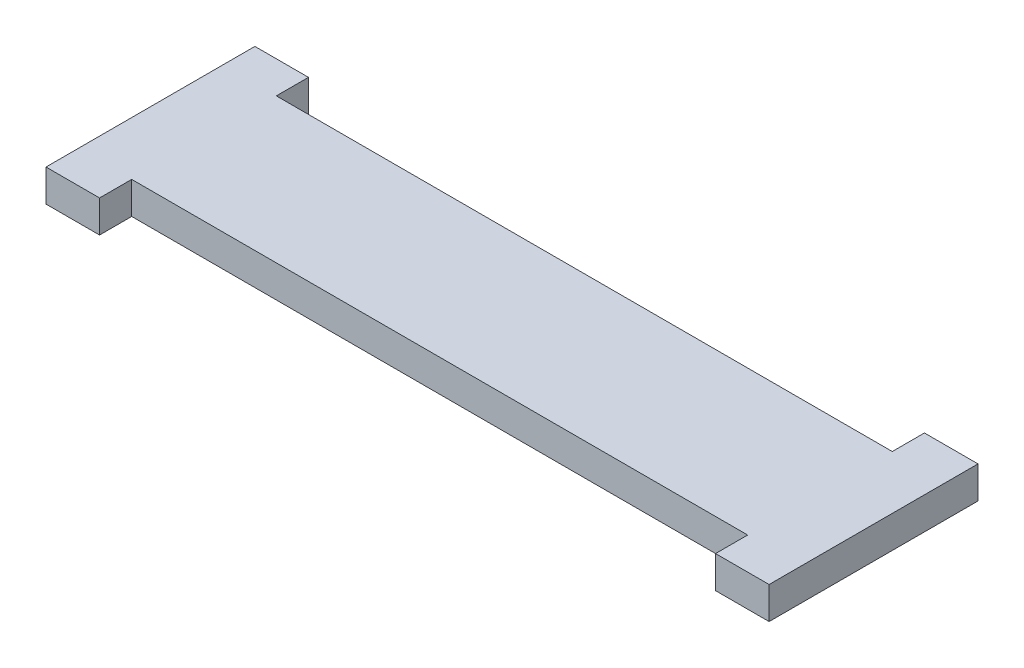
ISO-10303-21;
HEADER;
FILE_DESCRIPTION(('STEP AP214'),'2;1');
FILE_NAME('part.step','',(''),(''),'','','');
FILE_SCHEMA(('AUTOMOTIVE_DESIGN { 1 0 10303 214 1 1 1 1 }'));
ENDSEC;
DATA;
#1=APPLICATION_CONTEXT('core data for automotive mechanical design processes');
#2=APPLICATION_PROTOCOL_DEFINITION('international standard','automotive_design',2000,#1);
#3=PRODUCT_CONTEXT('',#1,'mechanical');
#4=PRODUCT('Part','Part','',(#3));
#5=PRODUCT_RELATED_PRODUCT_CATEGORY('part','',(#4));
#6=PRODUCT_DEFINITION_FORMATION('','',#4);
#7=PRODUCT_DEFINITION_CONTEXT('part definition',#1,'design');
#8=PRODUCT_DEFINITION('design','',#6,#7);
#9=PRODUCT_DEFINITION_SHAPE('','',#8);
#10=(LENGTH_UNIT() NAMED_UNIT(*) SI_UNIT(.MILLI.,.METRE.));
#11=(NAMED_UNIT(*) PLANE_ANGLE_UNIT() SI_UNIT($,.RADIAN.));
#12=(NAMED_UNIT(*) SI_UNIT($,.STERADIAN.) SOLID_ANGLE_UNIT());
#13=UNCERTAINTY_MEASURE_WITH_UNIT(LENGTH_MEASURE(1.E-05),#10,'distance_accuracy_value','');
#14=(GEOMETRIC_REPRESENTATION_CONTEXT(3) GLOBAL_UNCERTAINTY_ASSIGNED_CONTEXT((#13)) GLOBAL_UNIT_ASSIGNED_CONTEXT((#10,
#11,#12)) REPRESENTATION_CONTEXT('',''));
#15=CARTESIAN_POINT('',(0.,0.,0.));
#16=DIRECTION('',(0.,0.,1.));
#17=DIRECTION('',(1.,0.,0.));
#18=AXIS2_PLACEMENT_3D('',#15,#16,#17);
#19=CARTESIAN_POINT('',(-57.5,19.5,-5.));
#20=DIRECTION('',(1.,0.,0.));
#21=DIRECTION('',(0.,0.,-1.));
#22=AXIS2_PLACEMENT_3D('',#19,#20,#21);
#23=PLANE('',#22);
#24=DIRECTION('',(0.,1.,0.));
#25=VECTOR('',#24,1.);
#26=CARTESIAN_POINT('',(-57.5,19.5,0.999999999999994));
#27=LINE('',#26,#25);
#28=CARTESIAN_POINT('',(-57.5,13.5,0.999999999999994));
#29=VERTEX_POINT('',#28);
#30=CARTESIAN_POINT('',(-57.5,19.5,0.999999999999994));
#31=VERTEX_POINT('',#30);
#32=EDGE_CURVE('E11',#29,#31,#27,.T.);
#33=ORIENTED_EDGE('',*,*,#32,.F.);
#34=DIRECTION('',(0.,0.,1.));
#35=VECTOR('',#34,1.);
#36=CARTESIAN_POINT('',(-57.5,13.5,0.));
#37=LINE('',#36,#35);
#38=CARTESIAN_POINT('',(-57.5,13.5,-5.));
#39=VERTEX_POINT('',#38);
#40=EDGE_CURVE('E120',#29,#39,#37,.F.);
#41=ORIENTED_EDGE('',*,*,#40,.T.);
#42=DIRECTION('',(0.,1.,0.));
#43=VECTOR('',#42,1.);
#44=CARTESIAN_POINT('',(-57.5,19.5,-5.));
#45=LINE('',#44,#43);
#46=CARTESIAN_POINT('',(-57.5,19.5,-5.));
#47=VERTEX_POINT('',#46);
#48=EDGE_CURVE('E50',#39,#47,#45,.T.);
#49=ORIENTED_EDGE('',*,*,#48,.T.);
#50=DIRECTION('',(0.,0.,-1.));
#51=VECTOR('',#50,1.);
#52=CARTESIAN_POINT('',(-57.5,19.5,-5.));
#53=LINE('',#52,#51);
#54=EDGE_CURVE('E208',#31,#47,#53,.T.);
#55=ORIENTED_EDGE('',*,*,#54,.F.);
#56=EDGE_LOOP('',(#33,#41,#49,#55));
#57=FACE_BOUND('',#56,.T.);
#58=ADVANCED_FACE('F39',(#57),#23,.T.);
#59=CARTESIAN_POINT('',(57.5,19.5,-5.));
#60=DIRECTION('',(0.,0.,1.));
#61=DIRECTION('',(1.,0.,0.));
#62=AXIS2_PLACEMENT_3D('',#59,#60,#61);
#63=PLANE('',#62);
#64=ORIENTED_EDGE('',*,*,#48,.F.);
#65=DIRECTION('',(1.,0.,0.));
#66=VECTOR('',#65,1.);
#67=CARTESIAN_POINT('',(0.,13.5,-5.));
#68=LINE('',#67,#66);
#69=CARTESIAN_POINT('',(57.5,13.5,-5.));
#70=VERTEX_POINT('',#69);
#71=EDGE_CURVE('E162',#39,#70,#68,.T.);
#72=ORIENTED_EDGE('',*,*,#71,.T.);
#73=DIRECTION('',(0.,1.,0.));
#74=VECTOR('',#73,1.);
#75=CARTESIAN_POINT('',(57.5,19.5,-5.));
#76=LINE('',#75,#74);
#77=CARTESIAN_POINT('',(57.5,19.5,-5.));
#78=VERTEX_POINT('',#77);
#79=EDGE_CURVE('E197',#70,#78,#76,.T.);
#80=ORIENTED_EDGE('',*,*,#79,.T.);
#81=DIRECTION('',(1.,0.,0.));
#82=VECTOR('',#81,1.);
#83=CARTESIAN_POINT('',(57.5,19.5,-5.));
#84=LINE('',#83,#82);
#85=EDGE_CURVE('E217',#47,#78,#84,.T.);
#86=ORIENTED_EDGE('',*,*,#85,.F.);
#87=EDGE_LOOP('',(#64,#72,#80,#86));
#88=FACE_BOUND('',#87,.T.);
#89=ADVANCED_FACE('F220',(#88),#63,.T.);
#90=CARTESIAN_POINT('',(57.5,19.5,-5.));
#91=DIRECTION('',(-1.,0.,0.));
#92=DIRECTION('',(0.,0.,1.));
#93=AXIS2_PLACEMENT_3D('',#90,#91,#92);
#94=PLANE('',#93);
#95=ORIENTED_EDGE('',*,*,#79,.F.);
#96=DIRECTION('',(0.,0.,1.));
#97=VECTOR('',#96,1.);
#98=CARTESIAN_POINT('',(57.5,13.5,0.));
#99=LINE('',#98,#97);
#100=CARTESIAN_POINT('',(57.5,13.5,1.));
#101=VERTEX_POINT('',#100);
#102=EDGE_CURVE('E158',#70,#101,#99,.T.);
#103=ORIENTED_EDGE('',*,*,#102,.T.);
#104=DIRECTION('',(0.,1.,0.));
#105=VECTOR('',#104,1.);
#106=CARTESIAN_POINT('',(57.5,19.5,1.));
#107=LINE('',#106,#105);
#108=CARTESIAN_POINT('',(57.5,19.5,1.));
#109=VERTEX_POINT('',#108);
#110=EDGE_CURVE('E193',#101,#109,#107,.T.);
#111=ORIENTED_EDGE('',*,*,#110,.T.);
#112=DIRECTION('',(0.,0.,1.));
#113=VECTOR('',#112,1.);
#114=CARTESIAN_POINT('',(57.5,19.5,-5.));
#115=LINE('',#114,#113);
#116=EDGE_CURVE('E222',#78,#109,#115,.T.);
#117=ORIENTED_EDGE('',*,*,#116,.F.);
#118=EDGE_LOOP('',(#95,#103,#111,#117));
#119=FACE_BOUND('',#118,.T.);
#120=ADVANCED_FACE('F289',(#119),#94,.T.);
#121=CARTESIAN_POINT('',(67.5,19.5,1.));
#122=DIRECTION('',(0.,0.,1.));
#123=DIRECTION('',(1.,0.,0.));
#124=AXIS2_PLACEMENT_3D('',#121,#122,#123);
#125=PLANE('',#124);
#126=ORIENTED_EDGE('',*,*,#110,.F.);
#127=DIRECTION('',(1.,0.,0.));
#128=VECTOR('',#127,1.);
#129=CARTESIAN_POINT('',(0.,13.5,1.));
#130=LINE('',#129,#128);
#131=CARTESIAN_POINT('',(67.5,13.5,1.));
#132=VERTEX_POINT('',#131);
#133=EDGE_CURVE('E154',#101,#132,#130,.T.);
#134=ORIENTED_EDGE('',*,*,#133,.T.);
#135=DIRECTION('',(0.,1.,0.));
#136=VECTOR('',#135,1.);
#137=CARTESIAN_POINT('',(67.5,19.5,1.));
#138=LINE('',#137,#136);
#139=CARTESIAN_POINT('',(67.5,19.5,1.));
#140=VERTEX_POINT('',#139);
#141=EDGE_CURVE('E189',#132,#140,#138,.T.);
#142=ORIENTED_EDGE('',*,*,#141,.T.);
#143=DIRECTION('',(1.,0.,0.));
#144=VECTOR('',#143,1.);
#145=CARTESIAN_POINT('',(67.5,19.5,1.));
#146=LINE('',#145,#144);
#147=EDGE_CURVE('E226',#109,#140,#146,.T.);
#148=ORIENTED_EDGE('',*,*,#147,.F.);
#149=EDGE_LOOP('',(#126,#134,#142,#148));
#150=FACE_BOUND('',#149,.T.);
#151=ADVANCED_FACE('F294',(#150),#125,.T.);
#152=CARTESIAN_POINT('',(67.5,19.5,-5.));
#153=DIRECTION('',(1.,0.,0.));
#154=DIRECTION('',(0.,0.,-1.));
#155=AXIS2_PLACEMENT_3D('',#152,#153,#154);
#156=PLANE('',#155);
#157=ORIENTED_EDGE('',*,*,#141,.F.);
#158=DIRECTION('',(0.,0.,1.));
#159=VECTOR('',#158,1.);
#160=CARTESIAN_POINT('',(67.5,13.5,0.));
#161=LINE('',#160,#159);
#162=CARTESIAN_POINT('',(67.5,13.5,-38.));
#163=VERTEX_POINT('',#162);
#164=EDGE_CURVE('E150',#132,#163,#161,.F.);
#165=ORIENTED_EDGE('',*,*,#164,.T.);
#166=DIRECTION('',(0.,1.,0.));
#167=VECTOR('',#166,1.);
#168=CARTESIAN_POINT('',(67.5,19.5,-38.));
#169=LINE('',#168,#167);
#170=CARTESIAN_POINT('',(67.5,19.5,-38.));
#171=VERTEX_POINT('',#170);
#172=EDGE_CURVE('E185',#163,#171,#169,.T.);
#173=ORIENTED_EDGE('',*,*,#172,.T.);
#174=DIRECTION('',(0.,0.,-1.));
#175=VECTOR('',#174,1.);
#176=CARTESIAN_POINT('',(67.5,19.5,-5.));
#177=LINE('',#176,#175);
#178=EDGE_CURVE('E233',#140,#171,#177,.T.);
#179=ORIENTED_EDGE('',*,*,#178,.F.);
#180=EDGE_LOOP('',(#157,#165,#173,#179));
#181=FACE_BOUND('',#180,.T.);
#182=ADVANCED_FACE('F296',(#181),#156,.T.);
#183=CARTESIAN_POINT('',(67.5,19.5,-38.));
#184=DIRECTION('',(0.,0.,-1.));
#185=DIRECTION('',(-1.,0.,0.));
#186=AXIS2_PLACEMENT_3D('',#183,#184,#185);
#187=PLANE('',#186);
#188=ORIENTED_EDGE('',*,*,#172,.F.);
#189=DIRECTION('',(1.,0.,0.));
#190=VECTOR('',#189,1.);
#191=CARTESIAN_POINT('',(0.,13.5,-38.));
#192=LINE('',#191,#190);
#193=CARTESIAN_POINT('',(57.5,13.5,-38.));
#194=VERTEX_POINT('',#193);
#195=EDGE_CURVE('E146',#163,#194,#192,.F.);
#196=ORIENTED_EDGE('',*,*,#195,.T.);
#197=DIRECTION('',(0.,1.,0.));
#198=VECTOR('',#197,1.);
#199=CARTESIAN_POINT('',(57.5,19.5,-38.));
#200=LINE('',#199,#198);
#201=CARTESIAN_POINT('',(57.5,19.5,-38.));
#202=VERTEX_POINT('',#201);
#203=EDGE_CURVE('E181',#194,#202,#200,.T.);
#204=ORIENTED_EDGE('',*,*,#203,.T.);
#205=DIRECTION('',(-1.,0.,0.));
#206=VECTOR('',#205,1.);
#207=CARTESIAN_POINT('',(67.5,19.5,-38.));
#208=LINE('',#207,#206);
#209=EDGE_CURVE('E237',#171,#202,#208,.T.);
#210=ORIENTED_EDGE('',*,*,#209,.F.);
#211=EDGE_LOOP('',(#188,#196,#204,#210));
#212=FACE_BOUND('',#211,.T.);
#213=ADVANCED_FACE('F277',(#212),#187,.T.);
#214=CARTESIAN_POINT('',(57.5,19.5,-32.));
#215=DIRECTION('',(-1.,0.,0.));
#216=DIRECTION('',(0.,0.,1.));
#217=AXIS2_PLACEMENT_3D('',#214,#215,#216);
#218=PLANE('',#217);
#219=ORIENTED_EDGE('',*,*,#203,.F.);
#220=DIRECTION('',(0.,0.,1.));
#221=VECTOR('',#220,1.);
#222=CARTESIAN_POINT('',(57.5,13.5,0.));
#223=LINE('',#222,#221);
#224=CARTESIAN_POINT('',(57.5,13.5,-32.));
#225=VERTEX_POINT('',#224);
#226=EDGE_CURVE('E142',#194,#225,#223,.T.);
#227=ORIENTED_EDGE('',*,*,#226,.T.);
#228=DIRECTION('',(0.,1.,0.));
#229=VECTOR('',#228,1.);
#230=CARTESIAN_POINT('',(57.5,19.5,-32.));
#231=LINE('',#230,#229);
#232=CARTESIAN_POINT('',(57.5,19.5,-32.));
#233=VERTEX_POINT('',#232);
#234=EDGE_CURVE('E177',#225,#233,#231,.T.);
#235=ORIENTED_EDGE('',*,*,#234,.T.);
#236=DIRECTION('',(0.,0.,1.));
#237=VECTOR('',#236,1.);
#238=CARTESIAN_POINT('',(57.5,19.5,-32.));
#239=LINE('',#238,#237);
#240=EDGE_CURVE('E241',#202,#233,#239,.T.);
#241=ORIENTED_EDGE('',*,*,#240,.F.);
#242=EDGE_LOOP('',(#219,#227,#235,#241));
#243=FACE_BOUND('',#242,.T.);
#244=ADVANCED_FACE('F269',(#243),#218,.T.);
#245=CARTESIAN_POINT('',(57.5,19.5,-32.));
#246=DIRECTION('',(0.,0.,-1.));
#247=DIRECTION('',(-1.,0.,0.));
#248=AXIS2_PLACEMENT_3D('',#245,#246,#247);
#249=PLANE('',#248);
#250=ORIENTED_EDGE('',*,*,#234,.F.);
#251=DIRECTION('',(1.,0.,0.));
#252=VECTOR('',#251,1.);
#253=CARTESIAN_POINT('',(0.,13.5,-32.));
#254=LINE('',#253,#252);
#255=CARTESIAN_POINT('',(-57.5,13.5,-32.));
#256=VERTEX_POINT('',#255);
#257=EDGE_CURVE('E138',#225,#256,#254,.F.);
#258=ORIENTED_EDGE('',*,*,#257,.T.);
#259=DIRECTION('',(0.,1.,0.));
#260=VECTOR('',#259,1.);
#261=CARTESIAN_POINT('',(-57.5,19.5,-32.));
#262=LINE('',#261,#260);
#263=CARTESIAN_POINT('',(-57.5,19.5,-32.));
#264=VERTEX_POINT('',#263);
#265=EDGE_CURVE('E173',#256,#264,#262,.T.);
#266=ORIENTED_EDGE('',*,*,#265,.T.);
#267=DIRECTION('',(-1.,0.,0.));
#268=VECTOR('',#267,1.);
#269=CARTESIAN_POINT('',(57.5,19.5,-32.));
#270=LINE('',#269,#268);
#271=EDGE_CURVE('E245',#233,#264,#270,.T.);
#272=ORIENTED_EDGE('',*,*,#271,.F.);
#273=EDGE_LOOP('',(#250,#258,#266,#272));
#274=FACE_BOUND('',#273,.T.);
#275=ADVANCED_FACE('F264',(#274),#249,.T.);
#276=CARTESIAN_POINT('',(-57.5,19.5,-32.));
#277=DIRECTION('',(1.,0.,0.));
#278=DIRECTION('',(0.,0.,-1.));
#279=AXIS2_PLACEMENT_3D('',#276,#277,#278);
#280=PLANE('',#279);
#281=ORIENTED_EDGE('',*,*,#265,.F.);
#282=DIRECTION('',(0.,0.,1.));
#283=VECTOR('',#282,1.);
#284=CARTESIAN_POINT('',(-57.5,13.5,0.));
#285=LINE('',#284,#283);
#286=CARTESIAN_POINT('',(-57.5,13.5,-38.));
#287=VERTEX_POINT('',#286);
#288=EDGE_CURVE('E134',#256,#287,#285,.F.);
#289=ORIENTED_EDGE('',*,*,#288,.T.);
#290=DIRECTION('',(0.,1.,0.));
#291=VECTOR('',#290,1.);
#292=CARTESIAN_POINT('',(-57.5,19.5,-38.));
#293=LINE('',#292,#291);
#294=CARTESIAN_POINT('',(-57.5,19.5,-38.));
#295=VERTEX_POINT('',#294);
#296=EDGE_CURVE('E170',#287,#295,#293,.T.);
#297=ORIENTED_EDGE('',*,*,#296,.T.);
#298=DIRECTION('',(0.,0.,-1.));
#299=VECTOR('',#298,1.);
#300=CARTESIAN_POINT('',(-57.5,19.5,-32.));
#301=LINE('',#300,#299);
#302=EDGE_CURVE('E248',#264,#295,#301,.T.);
#303=ORIENTED_EDGE('',*,*,#302,.F.);
#304=EDGE_LOOP('',(#281,#289,#297,#303));
#305=FACE_BOUND('',#304,.T.);
#306=ADVANCED_FACE('F260',(#305),#280,.T.);
#307=CARTESIAN_POINT('',(-67.5,19.5,-38.));
#308=DIRECTION('',(0.,0.,-1.));
#309=DIRECTION('',(-1.,0.,0.));
#310=AXIS2_PLACEMENT_3D('',#307,#308,#309);
#311=PLANE('',#310);
#312=ORIENTED_EDGE('',*,*,#296,.F.);
#313=DIRECTION('',(1.,0.,0.));
#314=VECTOR('',#313,1.);
#315=CARTESIAN_POINT('',(0.,13.5,-38.));
#316=LINE('',#315,#314);
#317=CARTESIAN_POINT('',(-67.5,13.5,-38.));
#318=VERTEX_POINT('',#317);
#319=EDGE_CURVE('E131',#287,#318,#316,.F.);
#320=ORIENTED_EDGE('',*,*,#319,.T.);
#321=DIRECTION('',(0.,1.,0.));
#322=VECTOR('',#321,1.);
#323=CARTESIAN_POINT('',(-67.5,19.5,-38.));
#324=LINE('',#323,#322);
#325=CARTESIAN_POINT('',(-67.5,19.5,-38.));
#326=VERTEX_POINT('',#325);
#327=EDGE_CURVE('E58',#318,#326,#324,.T.);
#328=ORIENTED_EDGE('',*,*,#327,.T.);
#329=DIRECTION('',(-1.,0.,0.));
#330=VECTOR('',#329,1.);
#331=CARTESIAN_POINT('',(-67.5,19.5,-38.));
#332=LINE('',#331,#330);
#333=EDGE_CURVE('E113',#295,#326,#332,.T.);
#334=ORIENTED_EDGE('',*,*,#333,.F.);
#335=EDGE_LOOP('',(#312,#320,#328,#334));
#336=FACE_BOUND('',#335,.T.);
#337=ADVANCED_FACE('F257',(#336),#311,.T.);
#338=CARTESIAN_POINT('',(-67.5,19.5,-5.));
#339=DIRECTION('',(-1.,0.,0.));
#340=DIRECTION('',(0.,0.,1.));
#341=AXIS2_PLACEMENT_3D('',#338,#339,#340);
#342=PLANE('',#341);
#343=ORIENTED_EDGE('',*,*,#327,.F.);
#344=DIRECTION('',(0.,0.,1.));
#345=VECTOR('',#344,1.);
#346=CARTESIAN_POINT('',(-67.5,13.5,0.));
#347=LINE('',#346,#345);
#348=CARTESIAN_POINT('',(-67.5,13.5,0.999999999999994));
#349=VERTEX_POINT('',#348);
#350=EDGE_CURVE('E118',#318,#349,#347,.T.);
#351=ORIENTED_EDGE('',*,*,#350,.T.);
#352=DIRECTION('',(0.,1.,0.));
#353=VECTOR('',#352,1.);
#354=CARTESIAN_POINT('',(-67.5,19.5,0.999999999999994));
#355=LINE('',#354,#353);
#356=CARTESIAN_POINT('',(-67.5,19.5,0.999999999999994));
#357=VERTEX_POINT('',#356);
#358=EDGE_CURVE('E43',#349,#357,#355,.T.);
#359=ORIENTED_EDGE('',*,*,#358,.T.);
#360=DIRECTION('',(0.,0.,1.));
#361=VECTOR('',#360,1.);
#362=CARTESIAN_POINT('',(-67.5,19.5,-5.));
#363=LINE('',#362,#361);
#364=EDGE_CURVE('E133',#326,#357,#363,.T.);
#365=ORIENTED_EDGE('',*,*,#364,.F.);
#366=EDGE_LOOP('',(#343,#351,#359,#365));
#367=FACE_BOUND('',#366,.T.);
#368=ADVANCED_FACE('F123',(#367),#342,.T.);
#369=CARTESIAN_POINT('',(-67.5,19.5,0.999999999999994));
#370=DIRECTION('',(0.,0.,1.));
#371=DIRECTION('',(1.,0.,0.));
#372=AXIS2_PLACEMENT_3D('',#369,#370,#371);
#373=PLANE('',#372);
#374=DIRECTION('',(1.,0.,0.));
#375=VECTOR('',#374,1.);
#376=CARTESIAN_POINT('',(0.,13.5,0.999999999999994));
#377=LINE('',#376,#375);
#378=EDGE_CURVE('E106',#349,#29,#377,.T.);
#379=ORIENTED_EDGE('',*,*,#378,.T.);
#380=ORIENTED_EDGE('',*,*,#32,.T.);
#381=DIRECTION('',(1.,0.,0.));
#382=VECTOR('',#381,1.);
#383=CARTESIAN_POINT('',(-67.5,19.5,0.999999999999994));
#384=LINE('',#383,#382);
#385=EDGE_CURVE('E108',#357,#31,#384,.T.);
#386=ORIENTED_EDGE('',*,*,#385,.F.);
#387=ORIENTED_EDGE('',*,*,#358,.F.);
#388=EDGE_LOOP('',(#379,#380,#386,#387));
#389=FACE_BOUND('',#388,.T.);
#390=ADVANCED_FACE('F41',(#389),#373,.T.);
#391=CARTESIAN_POINT('',(0.,19.5,0.));
#392=DIRECTION('',(0.,1.,0.));
#393=DIRECTION('',(0.,0.,1.));
#394=AXIS2_PLACEMENT_3D('',#391,#392,#393);
#395=PLANE('',#394);
#396=ORIENTED_EDGE('',*,*,#364,.T.);
#397=ORIENTED_EDGE('',*,*,#385,.T.);
#398=ORIENTED_EDGE('',*,*,#54,.T.);
#399=ORIENTED_EDGE('',*,*,#85,.T.);
#400=ORIENTED_EDGE('',*,*,#116,.T.);
#401=ORIENTED_EDGE('',*,*,#147,.T.);
#402=ORIENTED_EDGE('',*,*,#178,.T.);
#403=ORIENTED_EDGE('',*,*,#209,.T.);
#404=ORIENTED_EDGE('',*,*,#240,.T.);
#405=ORIENTED_EDGE('',*,*,#271,.T.);
#406=ORIENTED_EDGE('',*,*,#302,.T.);
#407=ORIENTED_EDGE('',*,*,#333,.T.);
#408=EDGE_LOOP('',(#396,#397,#398,#399,#400,#401,#402,#403,#404,#405,#406,#407));
#409=FACE_BOUND('',#408,.T.);
#410=ADVANCED_FACE('F215',(#409),#395,.T.);
#411=CARTESIAN_POINT('',(0.,13.5,0.));
#412=DIRECTION('',(0.,1.,0.));
#413=DIRECTION('',(0.,0.,1.));
#414=AXIS2_PLACEMENT_3D('',#411,#412,#413);
#415=PLANE('',#414);
#416=ORIENTED_EDGE('',*,*,#350,.F.);
#417=ORIENTED_EDGE('',*,*,#319,.F.);
#418=ORIENTED_EDGE('',*,*,#288,.F.);
#419=ORIENTED_EDGE('',*,*,#257,.F.);
#420=ORIENTED_EDGE('',*,*,#226,.F.);
#421=ORIENTED_EDGE('',*,*,#195,.F.);
#422=ORIENTED_EDGE('',*,*,#164,.F.);
#423=ORIENTED_EDGE('',*,*,#133,.F.);
#424=ORIENTED_EDGE('',*,*,#102,.F.);
#425=ORIENTED_EDGE('',*,*,#71,.F.);
#426=ORIENTED_EDGE('',*,*,#40,.F.);
#427=ORIENTED_EDGE('',*,*,#378,.F.);
#428=EDGE_LOOP('',(#416,#417,#418,#419,#420,#421,#422,#423,#424,#425,#426,#427));
#429=FACE_BOUND('',#428,.T.);
#430=ADVANCED_FACE('F116',(#429),#415,.F.);
#431=CLOSED_SHELL('',(#58,#89,#120,#151,#182,#213,#244,#275,#306,#337,#368,#390,#410,#430));
#432=MANIFOLD_SOLID_BREP('B2',#431);
#433=ADVANCED_BREP_SHAPE_REPRESENTATION('',(#18,#432),#14);
#434=SHAPE_DEFINITION_REPRESENTATION(#9,#433);
ENDSEC;
END-ISO-10303-21;
